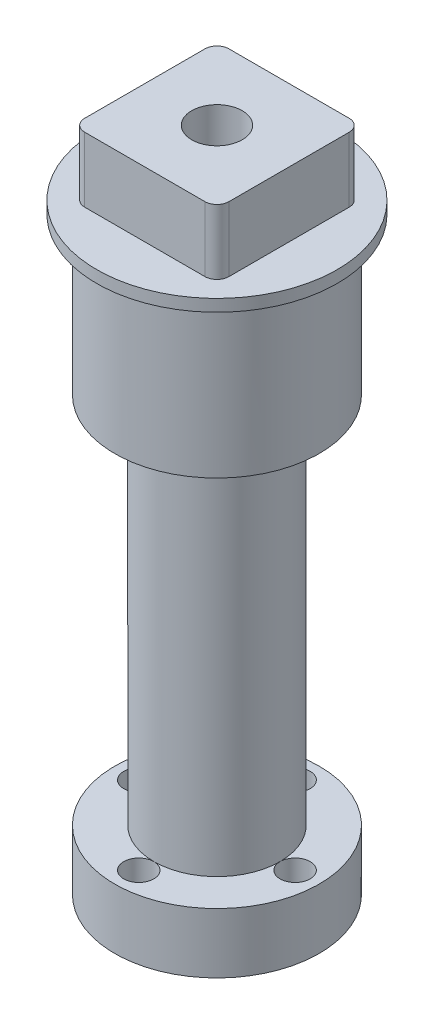
ISO-10303-21;
HEADER;
FILE_DESCRIPTION(('STEP AP214'),'2;1');
FILE_NAME('part.step','',(''),(''),'','','');
FILE_SCHEMA(('AUTOMOTIVE_DESIGN { 1 0 10303 214 1 1 1 1 }'));
ENDSEC;
DATA;
#1=APPLICATION_CONTEXT('core data for automotive mechanical design processes');
#2=APPLICATION_PROTOCOL_DEFINITION('international standard','automotive_design',2000,#1);
#3=PRODUCT_CONTEXT('',#1,'mechanical');
#4=PRODUCT('Part','Part','',(#3));
#5=PRODUCT_RELATED_PRODUCT_CATEGORY('part','',(#4));
#6=PRODUCT_DEFINITION_FORMATION('','',#4);
#7=PRODUCT_DEFINITION_CONTEXT('part definition',#1,'design');
#8=PRODUCT_DEFINITION('design','',#6,#7);
#9=PRODUCT_DEFINITION_SHAPE('','',#8);
#10=(LENGTH_UNIT() NAMED_UNIT(*) SI_UNIT(.MILLI.,.METRE.));
#11=(NAMED_UNIT(*) PLANE_ANGLE_UNIT() SI_UNIT($,.RADIAN.));
#12=(NAMED_UNIT(*) SI_UNIT($,.STERADIAN.) SOLID_ANGLE_UNIT());
#13=UNCERTAINTY_MEASURE_WITH_UNIT(LENGTH_MEASURE(1.E-05),#10,'distance_accuracy_value','');
#14=(GEOMETRIC_REPRESENTATION_CONTEXT(3) GLOBAL_UNCERTAINTY_ASSIGNED_CONTEXT((#13)) GLOBAL_UNIT_ASSIGNED_CONTEXT((#10,
#11,#12)) REPRESENTATION_CONTEXT('',''));
#15=CARTESIAN_POINT('',(0.,0.,0.));
#16=DIRECTION('',(0.,0.,1.));
#17=DIRECTION('',(1.,0.,0.));
#18=AXIS2_PLACEMENT_3D('',#15,#16,#17);
#19=CARTESIAN_POINT('',(0.,0.,0.));
#20=DIRECTION('',(0.,-1.,0.));
#21=DIRECTION('',(0.,0.,-1.));
#22=AXIS2_PLACEMENT_3D('',#19,#20,#21);
#23=CYLINDRICAL_SURFACE('',#22,8.5);
#24=CARTESIAN_POINT('',(0.,36.,0.));
#25=DIRECTION('',(0.,-1.,0.));
#26=DIRECTION('',(0.,0.,-1.));
#27=AXIS2_PLACEMENT_3D('',#24,#25,#26);
#28=CIRCLE('',#27,8.5);
#29=CARTESIAN_POINT('',(0.,36.,-8.5));
#30=VERTEX_POINT('',#29);
#31=EDGE_CURVE('E140',#30,#30,#28,.T.);
#32=ORIENTED_EDGE('',*,*,#31,.F.);
#33=EDGE_LOOP('',(#32));
#34=FACE_BOUND('',#33,.T.);
#35=CARTESIAN_POINT('',(0.,49.,0.));
#36=DIRECTION('',(0.,1.,0.));
#37=DIRECTION('',(0.,0.,1.));
#38=AXIS2_PLACEMENT_3D('',#35,#36,#37);
#39=CIRCLE('',#38,8.5);
#40=CARTESIAN_POINT('',(0.,49.,8.5));
#41=VERTEX_POINT('',#40);
#42=EDGE_CURVE('E11',#41,#41,#39,.T.);
#43=ORIENTED_EDGE('',*,*,#42,.F.);
#44=EDGE_LOOP('',(#43));
#45=FACE_BOUND('',#44,.T.);
#46=ADVANCED_FACE('F36',(#34,#45),#23,.T.);
#47=CARTESIAN_POINT('',(0.,0.,0.));
#48=DIRECTION('',(0.,-1.,0.));
#49=DIRECTION('',(0.,0.,-1.));
#50=AXIS2_PLACEMENT_3D('',#47,#48,#49);
#51=CYLINDRICAL_SURFACE('',#50,4.25);
#52=CARTESIAN_POINT('',(0.,44.,0.));
#53=DIRECTION('',(0.,-1.,0.));
#54=DIRECTION('',(0.,0.,-1.));
#55=AXIS2_PLACEMENT_3D('',#52,#53,#54);
#56=CIRCLE('',#55,4.25);
#57=CARTESIAN_POINT('',(0.,44.,-4.25));
#58=VERTEX_POINT('',#57);
#59=EDGE_CURVE('E528',#58,#58,#56,.T.);
#60=ORIENTED_EDGE('',*,*,#59,.F.);
#61=EDGE_LOOP('',(#60));
#62=FACE_BOUND('',#61,.T.);
#63=CARTESIAN_POINT('',(0.,0.,0.));
#64=DIRECTION('',(0.,-1.,0.));
#65=DIRECTION('',(0.,0.,-1.));
#66=AXIS2_PLACEMENT_3D('',#63,#64,#65);
#67=CIRCLE('',#66,4.25);
#68=CARTESIAN_POINT('',(0.,0.,-4.25));
#69=VERTEX_POINT('',#68);
#70=EDGE_CURVE('E118',#69,#69,#67,.T.);
#71=ORIENTED_EDGE('',*,*,#70,.T.);
#72=EDGE_LOOP('',(#71));
#73=FACE_BOUND('',#72,.T.);
#74=ADVANCED_FACE('F263',(#62,#73),#51,.F.);
#75=CARTESIAN_POINT('',(-8.5,36.,0.));
#76=DIRECTION('',(0.,1.,0.));
#77=DIRECTION('',(0.,0.,1.));
#78=AXIS2_PLACEMENT_3D('',#75,#76,#77);
#79=PLANE('',#78);
#80=CARTESIAN_POINT('',(0.,36.,0.));
#81=DIRECTION('',(0.,-1.,0.));
#82=DIRECTION('',(0.,0.,-1.));
#83=AXIS2_PLACEMENT_3D('',#80,#81,#82);
#84=CIRCLE('',#83,5.25);
#85=CARTESIAN_POINT('',(0.,36.,-5.25));
#86=VERTEX_POINT('',#85);
#87=EDGE_CURVE('E136',#86,#86,#84,.T.);
#88=ORIENTED_EDGE('',*,*,#87,.F.);
#89=EDGE_LOOP('',(#88));
#90=FACE_BOUND('',#89,.T.);
#91=ORIENTED_EDGE('',*,*,#31,.T.);
#92=EDGE_LOOP('',(#91));
#93=FACE_BOUND('',#92,.T.);
#94=ADVANCED_FACE('F269',(#90,#93),#79,.F.);
#95=CARTESIAN_POINT('',(0.,0.,0.));
#96=DIRECTION('',(0.,-1.,0.));
#97=DIRECTION('',(0.,0.,-1.));
#98=AXIS2_PLACEMENT_3D('',#95,#96,#97);
#99=CYLINDRICAL_SURFACE('',#98,5.25);
#100=CARTESIAN_POINT('',(0.,5.,0.));
#101=DIRECTION('',(0.,-1.,0.));
#102=DIRECTION('',(0.,0.,-1.));
#103=AXIS2_PLACEMENT_3D('',#100,#101,#102);
#104=CIRCLE('',#103,5.25);
#105=CARTESIAN_POINT('',(0.,5.,-5.25));
#106=VERTEX_POINT('',#105);
#107=CARTESIAN_POINT('',(5.25,5.,0.));
#108=VERTEX_POINT('',#107);
#109=EDGE_CURVE('E134',#106,#108,#104,.T.);
#110=ORIENTED_EDGE('',*,*,#109,.F.);
#111=CARTESIAN_POINT('',(-5.25,5.,0.));
#112=VERTEX_POINT('',#111);
#113=EDGE_CURVE('E133',#112,#106,#104,.T.);
#114=ORIENTED_EDGE('',*,*,#113,.F.);
#115=CARTESIAN_POINT('',(0.,5.,5.25));
#116=VERTEX_POINT('',#115);
#117=EDGE_CURVE('E238',#116,#112,#104,.T.);
#118=ORIENTED_EDGE('',*,*,#117,.F.);
#119=EDGE_CURVE('E137',#108,#116,#104,.T.);
#120=ORIENTED_EDGE('',*,*,#119,.F.);
#121=EDGE_LOOP('',(#110,#114,#118,#120));
#122=FACE_BOUND('',#121,.T.);
#123=ORIENTED_EDGE('',*,*,#87,.T.);
#124=EDGE_LOOP('',(#123));
#125=FACE_BOUND('',#124,.T.);
#126=ADVANCED_FACE('F240',(#122,#125),#99,.T.);
#127=CARTESIAN_POINT('',(-5.25,5.,0.));
#128=DIRECTION('',(0.,-1.,0.));
#129=DIRECTION('',(0.,0.,-1.));
#130=AXIS2_PLACEMENT_3D('',#127,#128,#129);
#131=PLANE('',#130);
#132=CARTESIAN_POINT('',(0.,5.,0.));
#133=DIRECTION('',(0.,-1.,0.));
#134=DIRECTION('',(0.,0.,-1.));
#135=AXIS2_PLACEMENT_3D('',#132,#133,#134);
#136=CIRCLE('',#135,8.5);
#137=CARTESIAN_POINT('',(0.,5.,-8.5));
#138=VERTEX_POINT('',#137);
#139=EDGE_CURVE('E130',#138,#138,#136,.T.);
#140=ORIENTED_EDGE('',*,*,#139,.F.);
#141=EDGE_LOOP('',(#140));
#142=FACE_BOUND('',#141,.T.);
#143=ORIENTED_EDGE('',*,*,#113,.T.);
#144=CARTESIAN_POINT('',(0.,5.,-6.5));
#145=DIRECTION('',(0.,-1.,0.));
#146=DIRECTION('',(0.,0.,-1.));
#147=AXIS2_PLACEMENT_3D('',#144,#145,#146);
#148=CIRCLE('',#147,1.25);
#149=EDGE_CURVE('E113',#106,#106,#148,.F.);
#150=ORIENTED_EDGE('',*,*,#149,.F.);
#151=ORIENTED_EDGE('',*,*,#109,.T.);
#152=CARTESIAN_POINT('',(6.5,5.,0.));
#153=DIRECTION('',(0.,-1.,0.));
#154=DIRECTION('',(0.,0.,-1.));
#155=AXIS2_PLACEMENT_3D('',#152,#153,#154);
#156=CIRCLE('',#155,1.25);
#157=EDGE_CURVE('E220',#108,#108,#156,.F.);
#158=ORIENTED_EDGE('',*,*,#157,.F.);
#159=ORIENTED_EDGE('',*,*,#119,.T.);
#160=CARTESIAN_POINT('',(0.,5.,6.5));
#161=DIRECTION('',(0.,-1.,0.));
#162=DIRECTION('',(0.,0.,-1.));
#163=AXIS2_PLACEMENT_3D('',#160,#161,#162);
#164=CIRCLE('',#163,1.25);
#165=EDGE_CURVE('E119',#116,#116,#164,.F.);
#166=ORIENTED_EDGE('',*,*,#165,.F.);
#167=ORIENTED_EDGE('',*,*,#117,.T.);
#168=CARTESIAN_POINT('',(-6.5,5.,0.));
#169=DIRECTION('',(0.,-1.,0.));
#170=DIRECTION('',(0.,0.,-1.));
#171=AXIS2_PLACEMENT_3D('',#168,#169,#170);
#172=CIRCLE('',#171,1.25);
#173=EDGE_CURVE('E124',#112,#112,#172,.F.);
#174=ORIENTED_EDGE('',*,*,#173,.F.);
#175=EDGE_LOOP('',(#143,#150,#151,#158,#159,#166,#167,#174));
#176=FACE_BOUND('',#175,.T.);
#177=ADVANCED_FACE('F234',(#142,#176),#131,.F.);
#178=CARTESIAN_POINT('',(0.,0.,0.));
#179=DIRECTION('',(0.,-1.,0.));
#180=DIRECTION('',(0.,0.,-1.));
#181=AXIS2_PLACEMENT_3D('',#178,#179,#180);
#182=CYLINDRICAL_SURFACE('',#181,8.5);
#183=CARTESIAN_POINT('',(0.,0.,0.));
#184=DIRECTION('',(0.,-1.,0.));
#185=DIRECTION('',(0.,0.,-1.));
#186=AXIS2_PLACEMENT_3D('',#183,#184,#185);
#187=CIRCLE('',#186,8.5);
#188=CARTESIAN_POINT('',(0.,0.,-8.5));
#189=VERTEX_POINT('',#188);
#190=EDGE_CURVE('E122',#189,#189,#187,.T.);
#191=ORIENTED_EDGE('',*,*,#190,.F.);
#192=EDGE_LOOP('',(#191));
#193=FACE_BOUND('',#192,.T.);
#194=ORIENTED_EDGE('',*,*,#139,.T.);
#195=EDGE_LOOP('',(#194));
#196=FACE_BOUND('',#195,.T.);
#197=ADVANCED_FACE('F258',(#193,#196),#182,.T.);
#198=CARTESIAN_POINT('',(-4.25,0.,0.));
#199=DIRECTION('',(0.,1.,0.));
#200=DIRECTION('',(0.,0.,1.));
#201=AXIS2_PLACEMENT_3D('',#198,#199,#200);
#202=PLANE('',#201);
#203=CARTESIAN_POINT('',(0.,0.,-6.5));
#204=DIRECTION('',(0.,1.,0.));
#205=DIRECTION('',(0.,0.,1.));
#206=AXIS2_PLACEMENT_3D('',#203,#204,#205);
#207=CIRCLE('',#206,1.25);
#208=CARTESIAN_POINT('',(0.,0.,-5.25));
#209=VERTEX_POINT('',#208);
#210=EDGE_CURVE('E217',#209,#209,#207,.T.);
#211=ORIENTED_EDGE('',*,*,#210,.T.);
#212=EDGE_LOOP('',(#211));
#213=FACE_BOUND('',#212,.T.);
#214=CARTESIAN_POINT('',(0.,0.,6.5));
#215=DIRECTION('',(0.,1.,0.));
#216=DIRECTION('',(0.,0.,1.));
#217=AXIS2_PLACEMENT_3D('',#214,#215,#216);
#218=CIRCLE('',#217,1.25);
#219=CARTESIAN_POINT('',(0.,0.,7.75));
#220=VERTEX_POINT('',#219);
#221=EDGE_CURVE('E221',#220,#220,#218,.T.);
#222=ORIENTED_EDGE('',*,*,#221,.T.);
#223=EDGE_LOOP('',(#222));
#224=FACE_BOUND('',#223,.T.);
#225=CARTESIAN_POINT('',(-6.5,0.,0.));
#226=DIRECTION('',(0.,1.,0.));
#227=DIRECTION('',(0.,0.,1.));
#228=AXIS2_PLACEMENT_3D('',#225,#226,#227);
#229=CIRCLE('',#228,1.25);
#230=CARTESIAN_POINT('',(-6.5,0.,1.25));
#231=VERTEX_POINT('',#230);
#232=EDGE_CURVE('E224',#231,#231,#229,.T.);
#233=ORIENTED_EDGE('',*,*,#232,.T.);
#234=EDGE_LOOP('',(#233));
#235=FACE_BOUND('',#234,.T.);
#236=CARTESIAN_POINT('',(6.5,0.,0.));
#237=DIRECTION('',(0.,1.,0.));
#238=DIRECTION('',(0.,0.,1.));
#239=AXIS2_PLACEMENT_3D('',#236,#237,#238);
#240=CIRCLE('',#239,1.25);
#241=CARTESIAN_POINT('',(6.5,0.,1.25));
#242=VERTEX_POINT('',#241);
#243=EDGE_CURVE('E209',#242,#242,#240,.T.);
#244=ORIENTED_EDGE('',*,*,#243,.T.);
#245=EDGE_LOOP('',(#244));
#246=FACE_BOUND('',#245,.T.);
#247=ORIENTED_EDGE('',*,*,#70,.F.);
#248=EDGE_LOOP('',(#247));
#249=FACE_BOUND('',#248,.T.);
#250=ORIENTED_EDGE('',*,*,#190,.T.);
#251=EDGE_LOOP('',(#250));
#252=FACE_BOUND('',#251,.T.);
#253=ADVANCED_FACE('F248',(#213,#224,#235,#246,#249,#252),#202,.F.);
#254=CARTESIAN_POINT('',(6.5,6.,0.));
#255=DIRECTION('',(0.,-1.,0.));
#256=DIRECTION('',(0.,0.,-1.));
#257=AXIS2_PLACEMENT_3D('',#254,#255,#256);
#258=CYLINDRICAL_SURFACE('',#257,1.25);
#259=ORIENTED_EDGE('',*,*,#243,.F.);
#260=EDGE_LOOP('',(#259));
#261=FACE_BOUND('',#260,.T.);
#262=ORIENTED_EDGE('',*,*,#157,.T.);
#263=EDGE_LOOP('',(#262));
#264=FACE_BOUND('',#263,.T.);
#265=ADVANCED_FACE('F246',(#261,#264),#258,.F.);
#266=CARTESIAN_POINT('',(-6.5,6.,0.));
#267=DIRECTION('',(0.,-1.,0.));
#268=DIRECTION('',(0.,0.,-1.));
#269=AXIS2_PLACEMENT_3D('',#266,#267,#268);
#270=CYLINDRICAL_SURFACE('',#269,1.25);
#271=ORIENTED_EDGE('',*,*,#232,.F.);
#272=EDGE_LOOP('',(#271));
#273=FACE_BOUND('',#272,.T.);
#274=ORIENTED_EDGE('',*,*,#173,.T.);
#275=EDGE_LOOP('',(#274));
#276=FACE_BOUND('',#275,.T.);
#277=ADVANCED_FACE('F231',(#273,#276),#270,.F.);
#278=CARTESIAN_POINT('',(0.,6.,6.5));
#279=DIRECTION('',(0.,-1.,0.));
#280=DIRECTION('',(0.,0.,-1.));
#281=AXIS2_PLACEMENT_3D('',#278,#279,#280);
#282=CYLINDRICAL_SURFACE('',#281,1.25);
#283=ORIENTED_EDGE('',*,*,#221,.F.);
#284=EDGE_LOOP('',(#283));
#285=FACE_BOUND('',#284,.T.);
#286=ORIENTED_EDGE('',*,*,#165,.T.);
#287=EDGE_LOOP('',(#286));
#288=FACE_BOUND('',#287,.T.);
#289=ADVANCED_FACE('F255',(#285,#288),#282,.F.);
#290=CARTESIAN_POINT('',(0.,6.,-6.5));
#291=DIRECTION('',(0.,-1.,0.));
#292=DIRECTION('',(0.,0.,-1.));
#293=AXIS2_PLACEMENT_3D('',#290,#291,#292);
#294=CYLINDRICAL_SURFACE('',#293,1.25);
#295=ORIENTED_EDGE('',*,*,#210,.F.);
#296=EDGE_LOOP('',(#295));
#297=FACE_BOUND('',#296,.T.);
#298=ORIENTED_EDGE('',*,*,#149,.T.);
#299=EDGE_LOOP('',(#298));
#300=FACE_BOUND('',#299,.T.);
#301=ADVANCED_FACE('F114',(#297,#300),#294,.F.);
#302=CARTESIAN_POINT('',(-8.5,49.,0.));
#303=DIRECTION('',(0.,1.,0.));
#304=DIRECTION('',(0.,0.,1.));
#305=AXIS2_PLACEMENT_3D('',#302,#303,#304);
#306=PLANE('',#305);
#307=ORIENTED_EDGE('',*,*,#42,.T.);
#308=EDGE_LOOP('',(#307));
#309=FACE_BOUND('',#308,.T.);
#310=CARTESIAN_POINT('',(0.,49.,0.));
#311=DIRECTION('',(0.,-1.,0.));
#312=DIRECTION('',(0.,0.,-1.));
#313=AXIS2_PLACEMENT_3D('',#310,#311,#312);
#314=CIRCLE('',#313,10.);
#315=CARTESIAN_POINT('',(0.,49.,-10.));
#316=VERTEX_POINT('',#315);
#317=EDGE_CURVE('E185',#316,#316,#314,.T.);
#318=ORIENTED_EDGE('',*,*,#317,.T.);
#319=EDGE_LOOP('',(#318));
#320=FACE_BOUND('',#319,.T.);
#321=ADVANCED_FACE('F301',(#309,#320),#306,.F.);
#322=CARTESIAN_POINT('',(0.,0.,0.));
#323=DIRECTION('',(0.,-1.,0.));
#324=DIRECTION('',(0.,0.,-1.));
#325=AXIS2_PLACEMENT_3D('',#322,#323,#324);
#326=CYLINDRICAL_SURFACE('',#325,10.);
#327=ORIENTED_EDGE('',*,*,#317,.F.);
#328=EDGE_LOOP('',(#327));
#329=FACE_BOUND('',#328,.T.);
#330=CARTESIAN_POINT('',(0.,50.,0.));
#331=DIRECTION('',(0.,-1.,0.));
#332=DIRECTION('',(0.,0.,-1.));
#333=AXIS2_PLACEMENT_3D('',#330,#331,#332);
#334=CIRCLE('',#333,10.);
#335=CARTESIAN_POINT('',(0.,50.,-10.));
#336=VERTEX_POINT('',#335);
#337=EDGE_CURVE('E526',#336,#336,#334,.T.);
#338=ORIENTED_EDGE('',*,*,#337,.T.);
#339=EDGE_LOOP('',(#338));
#340=FACE_BOUND('',#339,.T.);
#341=ADVANCED_FACE('F295',(#329,#340),#326,.T.);
#342=CARTESIAN_POINT('',(0.,55.4,0.));
#343=DIRECTION('',(0.,1.,0.));
#344=DIRECTION('',(0.,0.,1.));
#345=AXIS2_PLACEMENT_3D('',#342,#343,#344);
#346=PLANE('',#345);
#347=CARTESIAN_POINT('',(0.,55.4,0.));
#348=DIRECTION('',(0.,1.,0.));
#349=DIRECTION('',(0.,0.,1.));
#350=AXIS2_PLACEMENT_3D('',#347,#348,#349);
#351=CIRCLE('',#350,2.1);
#352=CARTESIAN_POINT('',(0.,55.4,2.1));
#353=VERTEX_POINT('',#352);
#354=EDGE_CURVE('E536',#353,#353,#351,.T.);
#355=ORIENTED_EDGE('',*,*,#354,.F.);
#356=EDGE_LOOP('',(#355));
#357=FACE_BOUND('',#356,.T.);
#358=DIRECTION('',(1.,0.,0.));
#359=VECTOR('',#358,1.);
#360=CARTESIAN_POINT('',(-6.,55.4,6.));
#361=LINE('',#360,#359);
#362=CARTESIAN_POINT('',(-5.,55.4,6.));
#363=VERTEX_POINT('',#362);
#364=CARTESIAN_POINT('',(5.,55.4,6.));
#365=VERTEX_POINT('',#364);
#366=EDGE_CURVE('E203',#363,#365,#361,.T.);
#367=ORIENTED_EDGE('',*,*,#366,.T.);
#368=CARTESIAN_POINT('',(5.,55.4,5.));
#369=DIRECTION('',(0.,1.,0.));
#370=DIRECTION('',(0.,0.,1.));
#371=AXIS2_PLACEMENT_3D('',#368,#369,#370);
#372=CIRCLE('',#371,1.);
#373=CARTESIAN_POINT('',(6.,55.4,5.));
#374=VERTEX_POINT('',#373);
#375=EDGE_CURVE('E159',#365,#374,#372,.T.);
#376=ORIENTED_EDGE('',*,*,#375,.T.);
#377=DIRECTION('',(0.,0.,-1.));
#378=VECTOR('',#377,1.);
#379=CARTESIAN_POINT('',(6.,55.4,-6.));
#380=LINE('',#379,#378);
#381=CARTESIAN_POINT('',(6.,55.4,-5.));
#382=VERTEX_POINT('',#381);
#383=EDGE_CURVE('E196',#374,#382,#380,.T.);
#384=ORIENTED_EDGE('',*,*,#383,.T.);
#385=CARTESIAN_POINT('',(5.,55.4,-5.));
#386=DIRECTION('',(0.,1.,0.));
#387=DIRECTION('',(0.,0.,1.));
#388=AXIS2_PLACEMENT_3D('',#385,#386,#387);
#389=CIRCLE('',#388,1.);
#390=CARTESIAN_POINT('',(5.,55.4,-6.));
#391=VERTEX_POINT('',#390);
#392=EDGE_CURVE('E155',#382,#391,#389,.T.);
#393=ORIENTED_EDGE('',*,*,#392,.T.);
#394=DIRECTION('',(-1.,0.,0.));
#395=VECTOR('',#394,1.);
#396=CARTESIAN_POINT('',(-6.,55.4,-6.));
#397=LINE('',#396,#395);
#398=CARTESIAN_POINT('',(-5.,55.4,-6.));
#399=VERTEX_POINT('',#398);
#400=EDGE_CURVE('E194',#391,#399,#397,.T.);
#401=ORIENTED_EDGE('',*,*,#400,.T.);
#402=CARTESIAN_POINT('',(-5.,55.4,-5.));
#403=DIRECTION('',(0.,1.,0.));
#404=DIRECTION('',(0.,0.,1.));
#405=AXIS2_PLACEMENT_3D('',#402,#403,#404);
#406=CIRCLE('',#405,1.);
#407=CARTESIAN_POINT('',(-6.,55.4,-5.));
#408=VERTEX_POINT('',#407);
#409=EDGE_CURVE('E153',#399,#408,#406,.T.);
#410=ORIENTED_EDGE('',*,*,#409,.T.);
#411=DIRECTION('',(0.,0.,1.));
#412=VECTOR('',#411,1.);
#413=CARTESIAN_POINT('',(-6.,55.4,-6.));
#414=LINE('',#413,#412);
#415=CARTESIAN_POINT('',(-6.,55.4,5.));
#416=VERTEX_POINT('',#415);
#417=EDGE_CURVE('E200',#408,#416,#414,.T.);
#418=ORIENTED_EDGE('',*,*,#417,.T.);
#419=CARTESIAN_POINT('',(-5.,55.4,5.));
#420=DIRECTION('',(0.,1.,0.));
#421=DIRECTION('',(0.,0.,1.));
#422=AXIS2_PLACEMENT_3D('',#419,#420,#421);
#423=CIRCLE('',#422,1.);
#424=EDGE_CURVE('E157',#416,#363,#423,.T.);
#425=ORIENTED_EDGE('',*,*,#424,.T.);
#426=EDGE_LOOP('',(#367,#376,#384,#393,#401,#410,#418,#425));
#427=FACE_BOUND('',#426,.T.);
#428=ADVANCED_FACE('F193',(#357,#427),#346,.T.);
#429=CARTESIAN_POINT('',(5.,55.4,-5.));
#430=DIRECTION('',(0.,-1.,0.));
#431=DIRECTION('',(0.,0.,-1.));
#432=AXIS2_PLACEMENT_3D('',#429,#430,#431);
#433=CYLINDRICAL_SURFACE('',#432,1.);
#434=ORIENTED_EDGE('',*,*,#392,.F.);
#435=DIRECTION('',(0.,-1.,0.));
#436=VECTOR('',#435,1.);
#437=CARTESIAN_POINT('',(6.,55.4,-5.));
#438=LINE('',#437,#436);
#439=CARTESIAN_POINT('',(6.,50.,-5.));
#440=VERTEX_POINT('',#439);
#441=EDGE_CURVE('E143',#440,#382,#438,.F.);
#442=ORIENTED_EDGE('',*,*,#441,.F.);
#443=CARTESIAN_POINT('',(5.,50.,-5.));
#444=DIRECTION('',(0.,-1.,0.));
#445=DIRECTION('',(0.,0.,-1.));
#446=AXIS2_PLACEMENT_3D('',#443,#444,#445);
#447=CIRCLE('',#446,1.);
#448=CARTESIAN_POINT('',(5.,50.,-6.));
#449=VERTEX_POINT('',#448);
#450=EDGE_CURVE('E58',#449,#440,#447,.T.);
#451=ORIENTED_EDGE('',*,*,#450,.F.);
#452=DIRECTION('',(0.,-1.,0.));
#453=VECTOR('',#452,1.);
#454=CARTESIAN_POINT('',(5.,55.4,-6.));
#455=LINE('',#454,#453);
#456=EDGE_CURVE('E168',#391,#449,#455,.T.);
#457=ORIENTED_EDGE('',*,*,#456,.F.);
#458=EDGE_LOOP('',(#434,#442,#451,#457));
#459=FACE_BOUND('',#458,.T.);
#460=ADVANCED_FACE('F188',(#459),#433,.T.);
#461=CARTESIAN_POINT('',(-6.,55.4,-6.));
#462=DIRECTION('',(0.,0.,1.));
#463=DIRECTION('',(1.,0.,0.));
#464=AXIS2_PLACEMENT_3D('',#461,#462,#463);
#465=PLANE('',#464);
#466=ORIENTED_EDGE('',*,*,#400,.F.);
#467=ORIENTED_EDGE('',*,*,#456,.T.);
#468=DIRECTION('',(-1.,0.,0.));
#469=VECTOR('',#468,1.);
#470=CARTESIAN_POINT('',(-6.,50.,-6.));
#471=LINE('',#470,#469);
#472=CARTESIAN_POINT('',(-5.,50.,-6.));
#473=VERTEX_POINT('',#472);
#474=EDGE_CURVE('E179',#449,#473,#471,.T.);
#475=ORIENTED_EDGE('',*,*,#474,.T.);
#476=DIRECTION('',(0.,-1.,0.));
#477=VECTOR('',#476,1.);
#478=CARTESIAN_POINT('',(-5.,55.4,-6.));
#479=LINE('',#478,#477);
#480=EDGE_CURVE('E166',#473,#399,#479,.F.);
#481=ORIENTED_EDGE('',*,*,#480,.T.);
#482=EDGE_LOOP('',(#466,#467,#475,#481));
#483=FACE_BOUND('',#482,.T.);
#484=ADVANCED_FACE('F198',(#483),#465,.F.);
#485=CARTESIAN_POINT('',(-5.,55.4,-5.));
#486=DIRECTION('',(0.,-1.,0.));
#487=DIRECTION('',(0.,0.,-1.));
#488=AXIS2_PLACEMENT_3D('',#485,#486,#487);
#489=CYLINDRICAL_SURFACE('',#488,1.);
#490=ORIENTED_EDGE('',*,*,#409,.F.);
#491=ORIENTED_EDGE('',*,*,#480,.F.);
#492=CARTESIAN_POINT('',(-5.,50.,-5.));
#493=DIRECTION('',(0.,-1.,0.));
#494=DIRECTION('',(0.,0.,-1.));
#495=AXIS2_PLACEMENT_3D('',#492,#493,#494);
#496=CIRCLE('',#495,1.);
#497=CARTESIAN_POINT('',(-6.,50.,-5.));
#498=VERTEX_POINT('',#497);
#499=EDGE_CURVE('E44',#498,#473,#496,.T.);
#500=ORIENTED_EDGE('',*,*,#499,.F.);
#501=DIRECTION('',(0.,-1.,0.));
#502=VECTOR('',#501,1.);
#503=CARTESIAN_POINT('',(-6.,55.4,-5.));
#504=LINE('',#503,#502);
#505=EDGE_CURVE('E161',#408,#498,#504,.T.);
#506=ORIENTED_EDGE('',*,*,#505,.F.);
#507=EDGE_LOOP('',(#490,#491,#500,#506));
#508=FACE_BOUND('',#507,.T.);
#509=ADVANCED_FACE('F38',(#508),#489,.T.);
#510=CARTESIAN_POINT('',(-6.,55.4,-6.));
#511=DIRECTION('',(1.,0.,0.));
#512=DIRECTION('',(0.,0.,-1.));
#513=AXIS2_PLACEMENT_3D('',#510,#511,#512);
#514=PLANE('',#513);
#515=DIRECTION('',(0.,0.,1.));
#516=VECTOR('',#515,1.);
#517=CARTESIAN_POINT('',(-6.,50.,-6.));
#518=LINE('',#517,#516);
#519=CARTESIAN_POINT('',(-6.,50.,5.));
#520=VERTEX_POINT('',#519);
#521=EDGE_CURVE('E212',#498,#520,#518,.T.);
#522=ORIENTED_EDGE('',*,*,#521,.T.);
#523=DIRECTION('',(0.,-1.,0.));
#524=VECTOR('',#523,1.);
#525=CARTESIAN_POINT('',(-6.,55.4,5.));
#526=LINE('',#525,#524);
#527=EDGE_CURVE('E164',#520,#416,#526,.F.);
#528=ORIENTED_EDGE('',*,*,#527,.T.);
#529=ORIENTED_EDGE('',*,*,#417,.F.);
#530=ORIENTED_EDGE('',*,*,#505,.T.);
#531=EDGE_LOOP('',(#522,#528,#529,#530));
#532=FACE_BOUND('',#531,.T.);
#533=ADVANCED_FACE('F287',(#532),#514,.F.);
#534=CARTESIAN_POINT('',(-5.,55.4,5.));
#535=DIRECTION('',(0.,-1.,0.));
#536=DIRECTION('',(0.,0.,-1.));
#537=AXIS2_PLACEMENT_3D('',#534,#535,#536);
#538=CYLINDRICAL_SURFACE('',#537,1.);
#539=ORIENTED_EDGE('',*,*,#424,.F.);
#540=ORIENTED_EDGE('',*,*,#527,.F.);
#541=CARTESIAN_POINT('',(-5.,50.,5.));
#542=DIRECTION('',(0.,-1.,0.));
#543=DIRECTION('',(0.,0.,-1.));
#544=AXIS2_PLACEMENT_3D('',#541,#542,#543);
#545=CIRCLE('',#544,1.);
#546=CARTESIAN_POINT('',(-5.,50.,6.));
#547=VERTEX_POINT('',#546);
#548=EDGE_CURVE('E172',#547,#520,#545,.T.);
#549=ORIENTED_EDGE('',*,*,#548,.F.);
#550=DIRECTION('',(0.,-1.,0.));
#551=VECTOR('',#550,1.);
#552=CARTESIAN_POINT('',(-5.,55.4,6.));
#553=LINE('',#552,#551);
#554=EDGE_CURVE('E148',#363,#547,#553,.T.);
#555=ORIENTED_EDGE('',*,*,#554,.F.);
#556=EDGE_LOOP('',(#539,#540,#549,#555));
#557=FACE_BOUND('',#556,.T.);
#558=ADVANCED_FACE('F285',(#557),#538,.T.);
#559=CARTESIAN_POINT('',(-6.,55.4,6.));
#560=DIRECTION('',(0.,0.,-1.));
#561=DIRECTION('',(-1.,0.,0.));
#562=AXIS2_PLACEMENT_3D('',#559,#560,#561);
#563=PLANE('',#562);
#564=DIRECTION('',(1.,0.,0.));
#565=VECTOR('',#564,1.);
#566=CARTESIAN_POINT('',(-6.,50.,6.));
#567=LINE('',#566,#565);
#568=CARTESIAN_POINT('',(5.,50.,6.));
#569=VERTEX_POINT('',#568);
#570=EDGE_CURVE('E205',#547,#569,#567,.T.);
#571=ORIENTED_EDGE('',*,*,#570,.T.);
#572=DIRECTION('',(0.,-1.,0.));
#573=VECTOR('',#572,1.);
#574=CARTESIAN_POINT('',(5.,55.4,6.));
#575=LINE('',#574,#573);
#576=EDGE_CURVE('E151',#569,#365,#575,.F.);
#577=ORIENTED_EDGE('',*,*,#576,.T.);
#578=ORIENTED_EDGE('',*,*,#366,.F.);
#579=ORIENTED_EDGE('',*,*,#554,.T.);
#580=EDGE_LOOP('',(#571,#577,#578,#579));
#581=FACE_BOUND('',#580,.T.);
#582=ADVANCED_FACE('F283',(#581),#563,.F.);
#583=CARTESIAN_POINT('',(5.,55.4,5.));
#584=DIRECTION('',(0.,-1.,0.));
#585=DIRECTION('',(0.,0.,-1.));
#586=AXIS2_PLACEMENT_3D('',#583,#584,#585);
#587=CYLINDRICAL_SURFACE('',#586,1.);
#588=ORIENTED_EDGE('',*,*,#375,.F.);
#589=ORIENTED_EDGE('',*,*,#576,.F.);
#590=CARTESIAN_POINT('',(5.,50.,5.));
#591=DIRECTION('',(0.,-1.,0.));
#592=DIRECTION('',(0.,0.,-1.));
#593=AXIS2_PLACEMENT_3D('',#590,#591,#592);
#594=CIRCLE('',#593,1.);
#595=CARTESIAN_POINT('',(6.,50.,5.));
#596=VERTEX_POINT('',#595);
#597=EDGE_CURVE('E170',#596,#569,#594,.T.);
#598=ORIENTED_EDGE('',*,*,#597,.F.);
#599=DIRECTION('',(0.,-1.,0.));
#600=VECTOR('',#599,1.);
#601=CARTESIAN_POINT('',(6.,55.4,5.));
#602=LINE('',#601,#600);
#603=EDGE_CURVE('E145',#374,#596,#602,.T.);
#604=ORIENTED_EDGE('',*,*,#603,.F.);
#605=EDGE_LOOP('',(#588,#589,#598,#604));
#606=FACE_BOUND('',#605,.T.);
#607=ADVANCED_FACE('F280',(#606),#587,.T.);
#608=CARTESIAN_POINT('',(6.,55.4,-6.));
#609=DIRECTION('',(-1.,0.,0.));
#610=DIRECTION('',(0.,0.,1.));
#611=AXIS2_PLACEMENT_3D('',#608,#609,#610);
#612=PLANE('',#611);
#613=ORIENTED_EDGE('',*,*,#383,.F.);
#614=ORIENTED_EDGE('',*,*,#603,.T.);
#615=DIRECTION('',(0.,0.,-1.));
#616=VECTOR('',#615,1.);
#617=CARTESIAN_POINT('',(6.,50.,-6.));
#618=LINE('',#617,#616);
#619=EDGE_CURVE('E178',#596,#440,#618,.T.);
#620=ORIENTED_EDGE('',*,*,#619,.T.);
#621=ORIENTED_EDGE('',*,*,#441,.T.);
#622=EDGE_LOOP('',(#613,#614,#620,#621));
#623=FACE_BOUND('',#622,.T.);
#624=ADVANCED_FACE('F182',(#623),#612,.F.);
#625=CARTESIAN_POINT('',(-4.25,50.,0.));
#626=DIRECTION('',(0.,-1.,0.));
#627=DIRECTION('',(0.,0.,-1.));
#628=AXIS2_PLACEMENT_3D('',#625,#626,#627);
#629=PLANE('',#628);
#630=ORIENTED_EDGE('',*,*,#619,.F.);
#631=ORIENTED_EDGE('',*,*,#597,.T.);
#632=ORIENTED_EDGE('',*,*,#570,.F.);
#633=ORIENTED_EDGE('',*,*,#548,.T.);
#634=ORIENTED_EDGE('',*,*,#521,.F.);
#635=ORIENTED_EDGE('',*,*,#499,.T.);
#636=ORIENTED_EDGE('',*,*,#474,.F.);
#637=ORIENTED_EDGE('',*,*,#450,.T.);
#638=EDGE_LOOP('',(#630,#631,#632,#633,#634,#635,#636,#637));
#639=FACE_BOUND('',#638,.T.);
#640=ORIENTED_EDGE('',*,*,#337,.F.);
#641=EDGE_LOOP('',(#640));
#642=FACE_BOUND('',#641,.T.);
#643=ADVANCED_FACE('F176',(#639,#642),#629,.F.);
#644=CARTESIAN_POINT('',(0.,44.,0.));
#645=DIRECTION('',(0.,-1.,0.));
#646=DIRECTION('',(0.,0.,-1.));
#647=AXIS2_PLACEMENT_3D('',#644,#645,#646);
#648=PLANE('',#647);
#649=CARTESIAN_POINT('',(0.,44.,0.));
#650=DIRECTION('',(0.,-1.,0.));
#651=DIRECTION('',(0.,0.,-1.));
#652=AXIS2_PLACEMENT_3D('',#649,#650,#651);
#653=CIRCLE('',#652,2.09999999999999);
#654=CARTESIAN_POINT('',(0.,44.,-2.09999999999999));
#655=VERTEX_POINT('',#654);
#656=EDGE_CURVE('E533',#655,#655,#653,.T.);
#657=ORIENTED_EDGE('',*,*,#656,.F.);
#658=EDGE_LOOP('',(#657));
#659=FACE_BOUND('',#658,.T.);
#660=ORIENTED_EDGE('',*,*,#59,.T.);
#661=EDGE_LOOP('',(#660));
#662=FACE_BOUND('',#661,.T.);
#663=ADVANCED_FACE('F278',(#659,#662),#648,.T.);
#664=CARTESIAN_POINT('',(0.,55.4,0.));
#665=DIRECTION('',(0.,1.,0.));
#666=DIRECTION('',(0.,0.,1.));
#667=AXIS2_PLACEMENT_3D('',#664,#665,#666);
#668=CYLINDRICAL_SURFACE('',#667,2.09999999999999);
#669=ORIENTED_EDGE('',*,*,#656,.T.);
#670=EDGE_LOOP('',(#669));
#671=FACE_BOUND('',#670,.T.);
#672=ORIENTED_EDGE('',*,*,#354,.T.);
#673=EDGE_LOOP('',(#672));
#674=FACE_BOUND('',#673,.T.);
#675=ADVANCED_FACE('F375',(#671,#674),#668,.F.);
#676=CLOSED_SHELL('',(#46,#74,#94,#126,#177,#197,#253,#265,#277,#289,#301,#321,#341,#428,#460,
#484,#509,#533,#558,#582,#607,#624,#643,#663,#675));
#677=MANIFOLD_SOLID_BREP('B2',#676);
#678=ADVANCED_BREP_SHAPE_REPRESENTATION('',(#18,#677),#14);
#679=SHAPE_DEFINITION_REPRESENTATION(#9,#678);
ENDSEC;
END-ISO-10303-21;
